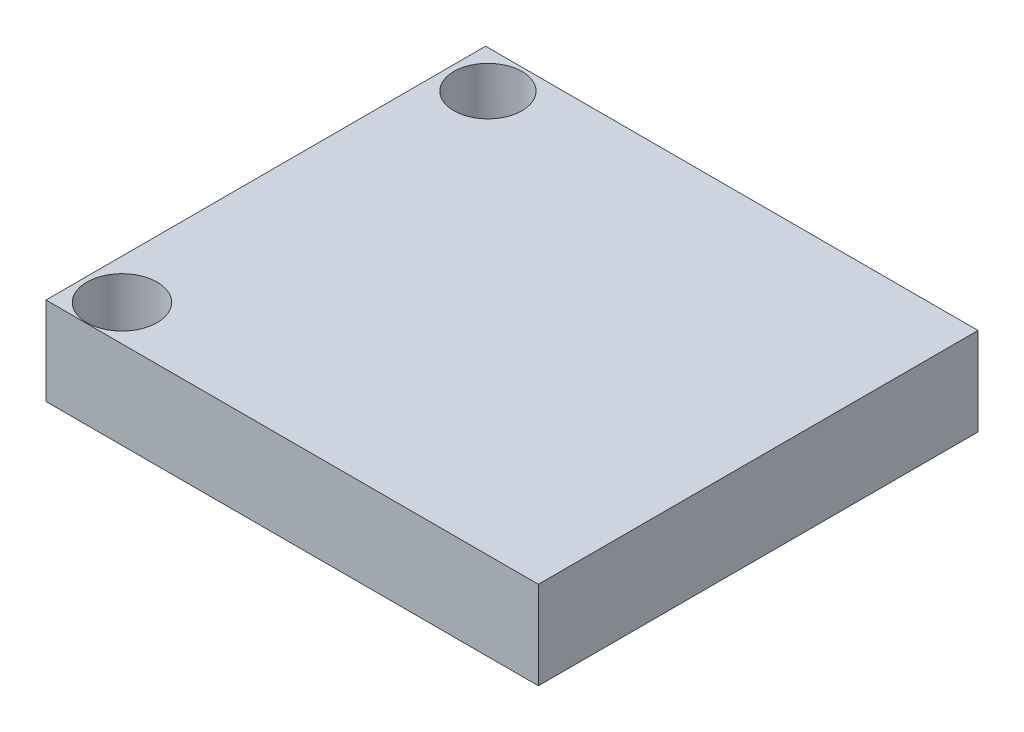
ISO-10303-21;
HEADER;
FILE_DESCRIPTION(('STEP AP214'),'2;1');
FILE_NAME('part.step','',(''),(''),'','','');
FILE_SCHEMA(('AUTOMOTIVE_DESIGN { 1 0 10303 214 1 1 1 1 }'));
ENDSEC;
DATA;
#1=APPLICATION_CONTEXT('core data for automotive mechanical design processes');
#2=APPLICATION_PROTOCOL_DEFINITION('international standard','automotive_design',2000,#1);
#3=PRODUCT_CONTEXT('',#1,'mechanical');
#4=PRODUCT('Part','Part','',(#3));
#5=PRODUCT_RELATED_PRODUCT_CATEGORY('part','',(#4));
#6=PRODUCT_DEFINITION_FORMATION('','',#4);
#7=PRODUCT_DEFINITION_CONTEXT('part definition',#1,'design');
#8=PRODUCT_DEFINITION('design','',#6,#7);
#9=PRODUCT_DEFINITION_SHAPE('','',#8);
#10=(LENGTH_UNIT() NAMED_UNIT(*) SI_UNIT(.MILLI.,.METRE.));
#11=(NAMED_UNIT(*) PLANE_ANGLE_UNIT() SI_UNIT($,.RADIAN.));
#12=(NAMED_UNIT(*) SI_UNIT($,.STERADIAN.) SOLID_ANGLE_UNIT());
#13=UNCERTAINTY_MEASURE_WITH_UNIT(LENGTH_MEASURE(1.E-05),#10,'distance_accuracy_value','');
#14=(GEOMETRIC_REPRESENTATION_CONTEXT(3) GLOBAL_UNCERTAINTY_ASSIGNED_CONTEXT((#13)) GLOBAL_UNIT_ASSIGNED_CONTEXT((#10,
#11,#12)) REPRESENTATION_CONTEXT('',''));
#15=CARTESIAN_POINT('',(0.,0.,0.));
#16=DIRECTION('',(0.,0.,1.));
#17=DIRECTION('',(1.,0.,0.));
#18=AXIS2_PLACEMENT_3D('',#15,#16,#17);
#19=CARTESIAN_POINT('',(14.,5.,12.5));
#20=DIRECTION('',(-1.,0.,0.));
#21=DIRECTION('',(0.,0.,1.));
#22=AXIS2_PLACEMENT_3D('',#19,#20,#21);
#23=PLANE('',#22);
#24=DIRECTION('',(0.,0.,-1.));
#25=VECTOR('',#24,1.);
#26=CARTESIAN_POINT('',(14.,0.,12.5));
#27=LINE('',#26,#25);
#28=CARTESIAN_POINT('',(14.,0.,12.5));
#29=VERTEX_POINT('',#28);
#30=CARTESIAN_POINT('',(14.,0.,-12.5));
#31=VERTEX_POINT('',#30);
#32=EDGE_CURVE('E115',#29,#31,#27,.T.);
#33=ORIENTED_EDGE('',*,*,#32,.T.);
#34=DIRECTION('',(0.,-1.,0.));
#35=VECTOR('',#34,1.);
#36=CARTESIAN_POINT('',(14.,5.,-12.5));
#37=LINE('',#36,#35);
#38=CARTESIAN_POINT('',(14.,5.,-12.5));
#39=VERTEX_POINT('',#38);
#40=EDGE_CURVE('E11',#39,#31,#37,.T.);
#41=ORIENTED_EDGE('',*,*,#40,.F.);
#42=DIRECTION('',(0.,0.,-1.));
#43=VECTOR('',#42,1.);
#44=CARTESIAN_POINT('',(14.,5.,12.5));
#45=LINE('',#44,#43);
#46=CARTESIAN_POINT('',(14.,5.,12.5));
#47=VERTEX_POINT('',#46);
#48=EDGE_CURVE('E98',#47,#39,#45,.T.);
#49=ORIENTED_EDGE('',*,*,#48,.F.);
#50=DIRECTION('',(0.,-1.,0.));
#51=VECTOR('',#50,1.);
#52=CARTESIAN_POINT('',(14.,5.,12.5));
#53=LINE('',#52,#51);
#54=EDGE_CURVE('E111',#47,#29,#53,.T.);
#55=ORIENTED_EDGE('',*,*,#54,.T.);
#56=EDGE_LOOP('',(#33,#41,#49,#55));
#57=FACE_BOUND('',#56,.T.);
#58=ADVANCED_FACE('F44',(#57),#23,.F.);
#59=CARTESIAN_POINT('',(-14.,5.,-12.5));
#60=DIRECTION('',(0.,0.,1.));
#61=DIRECTION('',(1.,0.,0.));
#62=AXIS2_PLACEMENT_3D('',#59,#60,#61);
#63=PLANE('',#62);
#64=DIRECTION('',(-1.,0.,0.));
#65=VECTOR('',#64,1.);
#66=CARTESIAN_POINT('',(-14.,0.,-12.5));
#67=LINE('',#66,#65);
#68=CARTESIAN_POINT('',(-14.,0.,-12.5));
#69=VERTEX_POINT('',#68);
#70=EDGE_CURVE('E103',#31,#69,#67,.T.);
#71=ORIENTED_EDGE('',*,*,#70,.T.);
#72=DIRECTION('',(0.,-1.,0.));
#73=VECTOR('',#72,1.);
#74=CARTESIAN_POINT('',(-14.,5.,-12.5));
#75=LINE('',#74,#73);
#76=CARTESIAN_POINT('',(-14.,5.,-12.5));
#77=VERTEX_POINT('',#76);
#78=EDGE_CURVE('E54',#77,#69,#75,.T.);
#79=ORIENTED_EDGE('',*,*,#78,.F.);
#80=DIRECTION('',(-1.,0.,0.));
#81=VECTOR('',#80,1.);
#82=CARTESIAN_POINT('',(-14.,5.,-12.5));
#83=LINE('',#82,#81);
#84=EDGE_CURVE('E93',#39,#77,#83,.T.);
#85=ORIENTED_EDGE('',*,*,#84,.F.);
#86=ORIENTED_EDGE('',*,*,#40,.T.);
#87=EDGE_LOOP('',(#71,#79,#85,#86));
#88=FACE_BOUND('',#87,.T.);
#89=ADVANCED_FACE('F102',(#88),#63,.F.);
#90=CARTESIAN_POINT('',(-14.,5.,12.5));
#91=DIRECTION('',(1.,0.,0.));
#92=DIRECTION('',(0.,0.,-1.));
#93=AXIS2_PLACEMENT_3D('',#90,#91,#92);
#94=PLANE('',#93);
#95=DIRECTION('',(0.,0.,1.));
#96=VECTOR('',#95,1.);
#97=CARTESIAN_POINT('',(-14.,0.,12.5));
#98=LINE('',#97,#96);
#99=CARTESIAN_POINT('',(-14.,0.,12.5));
#100=VERTEX_POINT('',#99);
#101=EDGE_CURVE('E80',#69,#100,#98,.T.);
#102=ORIENTED_EDGE('',*,*,#101,.T.);
#103=DIRECTION('',(0.,-1.,0.));
#104=VECTOR('',#103,1.);
#105=CARTESIAN_POINT('',(-14.,5.,12.5));
#106=LINE('',#105,#104);
#107=CARTESIAN_POINT('',(-14.,5.,12.5));
#108=VERTEX_POINT('',#107);
#109=EDGE_CURVE('E105',#108,#100,#106,.T.);
#110=ORIENTED_EDGE('',*,*,#109,.F.);
#111=DIRECTION('',(0.,0.,1.));
#112=VECTOR('',#111,1.);
#113=CARTESIAN_POINT('',(-14.,5.,12.5));
#114=LINE('',#113,#112);
#115=EDGE_CURVE('E96',#77,#108,#114,.T.);
#116=ORIENTED_EDGE('',*,*,#115,.F.);
#117=ORIENTED_EDGE('',*,*,#78,.T.);
#118=EDGE_LOOP('',(#102,#110,#116,#117));
#119=FACE_BOUND('',#118,.T.);
#120=ADVANCED_FACE('F107',(#119),#94,.F.);
#121=CARTESIAN_POINT('',(-14.,5.,12.5));
#122=DIRECTION('',(0.,0.,-1.));
#123=DIRECTION('',(-1.,0.,0.));
#124=AXIS2_PLACEMENT_3D('',#121,#122,#123);
#125=PLANE('',#124);
#126=DIRECTION('',(1.,0.,0.));
#127=VECTOR('',#126,1.);
#128=CARTESIAN_POINT('',(-14.,0.,12.5));
#129=LINE('',#128,#127);
#130=EDGE_CURVE('E86',#100,#29,#129,.T.);
#131=ORIENTED_EDGE('',*,*,#130,.T.);
#132=ORIENTED_EDGE('',*,*,#54,.F.);
#133=DIRECTION('',(1.,0.,0.));
#134=VECTOR('',#133,1.);
#135=CARTESIAN_POINT('',(-14.,5.,12.5));
#136=LINE('',#135,#134);
#137=EDGE_CURVE('E63',#108,#47,#136,.T.);
#138=ORIENTED_EDGE('',*,*,#137,.F.);
#139=ORIENTED_EDGE('',*,*,#109,.T.);
#140=EDGE_LOOP('',(#131,#132,#138,#139));
#141=FACE_BOUND('',#140,.T.);
#142=ADVANCED_FACE('F152',(#141),#125,.F.);
#143=CARTESIAN_POINT('',(0.,5.,0.));
#144=DIRECTION('',(0.,-1.,0.));
#145=DIRECTION('',(0.,0.,-1.));
#146=AXIS2_PLACEMENT_3D('',#143,#144,#145);
#147=PLANE('',#146);
#148=CARTESIAN_POINT('',(-11.7237249342899,5.,-10.3532905999111));
#149=DIRECTION('',(0.,1.,0.));
#150=DIRECTION('',(0.,0.,1.));
#151=AXIS2_PLACEMENT_3D('',#148,#149,#150);
#152=CIRCLE('',#151,1.93693975058173);
#153=CARTESIAN_POINT('',(-11.7237249342899,5.,-8.41635084932935));
#154=VERTEX_POINT('',#153);
#155=EDGE_CURVE('E131',#154,#154,#152,.T.);
#156=ORIENTED_EDGE('',*,*,#155,.F.);
#157=EDGE_LOOP('',(#156));
#158=FACE_BOUND('',#157,.T.);
#159=CARTESIAN_POINT('',(-11.7237249342899,5.,10.4564110584056));
#160=DIRECTION('',(0.,1.,0.));
#161=DIRECTION('',(0.,0.,1.));
#162=AXIS2_PLACEMENT_3D('',#159,#160,#161);
#163=CIRCLE('',#162,2.);
#164=CARTESIAN_POINT('',(-11.7237249342899,5.,12.4564110584056));
#165=VERTEX_POINT('',#164);
#166=EDGE_CURVE('E138',#165,#165,#163,.T.);
#167=ORIENTED_EDGE('',*,*,#166,.F.);
#168=EDGE_LOOP('',(#167));
#169=FACE_BOUND('',#168,.T.);
#170=ORIENTED_EDGE('',*,*,#48,.T.);
#171=ORIENTED_EDGE('',*,*,#84,.T.);
#172=ORIENTED_EDGE('',*,*,#115,.T.);
#173=ORIENTED_EDGE('',*,*,#137,.T.);
#174=EDGE_LOOP('',(#170,#171,#172,#173));
#175=FACE_BOUND('',#174,.T.);
#176=ADVANCED_FACE('F94',(#158,#169,#175),#147,.F.);
#177=CARTESIAN_POINT('',(0.,0.,0.));
#178=DIRECTION('',(0.,-1.,0.));
#179=DIRECTION('',(0.,0.,-1.));
#180=AXIS2_PLACEMENT_3D('',#177,#178,#179);
#181=PLANE('',#180);
#182=CARTESIAN_POINT('',(-11.7237249342899,0.,-10.3532905999111));
#183=DIRECTION('',(0.,-1.,0.));
#184=DIRECTION('',(0.,0.,-1.));
#185=AXIS2_PLACEMENT_3D('',#182,#183,#184);
#186=CIRCLE('',#185,1.93693975058173);
#187=CARTESIAN_POINT('',(-11.7237249342899,0.,-12.2902303504928));
#188=VERTEX_POINT('',#187);
#189=EDGE_CURVE('E47',#188,#188,#186,.T.);
#190=ORIENTED_EDGE('',*,*,#189,.F.);
#191=EDGE_LOOP('',(#190));
#192=FACE_BOUND('',#191,.T.);
#193=CARTESIAN_POINT('',(-11.7237249342899,0.,10.4564110584056));
#194=DIRECTION('',(0.,-1.,0.));
#195=DIRECTION('',(0.,0.,-1.));
#196=AXIS2_PLACEMENT_3D('',#193,#194,#195);
#197=CIRCLE('',#196,2.);
#198=CARTESIAN_POINT('',(-11.7237249342899,0.,8.45641105840562));
#199=VERTEX_POINT('',#198);
#200=EDGE_CURVE('E128',#199,#199,#197,.T.);
#201=ORIENTED_EDGE('',*,*,#200,.F.);
#202=EDGE_LOOP('',(#201));
#203=FACE_BOUND('',#202,.T.);
#204=ORIENTED_EDGE('',*,*,#32,.F.);
#205=ORIENTED_EDGE('',*,*,#130,.F.);
#206=ORIENTED_EDGE('',*,*,#101,.F.);
#207=ORIENTED_EDGE('',*,*,#70,.F.);
#208=EDGE_LOOP('',(#204,#205,#206,#207));
#209=FACE_BOUND('',#208,.T.);
#210=ADVANCED_FACE('F151',(#192,#203,#209),#181,.T.);
#211=CARTESIAN_POINT('',(-11.7237249342899,-5.,10.4564110584056));
#212=DIRECTION('',(0.,1.,0.));
#213=DIRECTION('',(0.,0.,1.));
#214=AXIS2_PLACEMENT_3D('',#211,#212,#213);
#215=CYLINDRICAL_SURFACE('',#214,2.);
#216=ORIENTED_EDGE('',*,*,#200,.T.);
#217=EDGE_LOOP('',(#216));
#218=FACE_BOUND('',#217,.T.);
#219=ORIENTED_EDGE('',*,*,#166,.T.);
#220=EDGE_LOOP('',(#219));
#221=FACE_BOUND('',#220,.T.);
#222=ADVANCED_FACE('F148',(#218,#221),#215,.F.);
#223=CARTESIAN_POINT('',(-11.7237249342899,-5.,-10.3532905999111));
#224=DIRECTION('',(0.,1.,0.));
#225=DIRECTION('',(0.,0.,1.));
#226=AXIS2_PLACEMENT_3D('',#223,#224,#225);
#227=CYLINDRICAL_SURFACE('',#226,1.93693975058173);
#228=ORIENTED_EDGE('',*,*,#189,.T.);
#229=EDGE_LOOP('',(#228));
#230=FACE_BOUND('',#229,.T.);
#231=ORIENTED_EDGE('',*,*,#155,.T.);
#232=EDGE_LOOP('',(#231));
#233=FACE_BOUND('',#232,.T.);
#234=ADVANCED_FACE('F201',(#230,#233),#227,.F.);
#235=CLOSED_SHELL('',(#58,#89,#120,#142,#176,#210,#222,#234));
#236=MANIFOLD_SOLID_BREP('B2',#235);
#237=ADVANCED_BREP_SHAPE_REPRESENTATION('',(#18,#236),#14);
#238=SHAPE_DEFINITION_REPRESENTATION(#9,#237);
ENDSEC;
END-ISO-10303-21;
